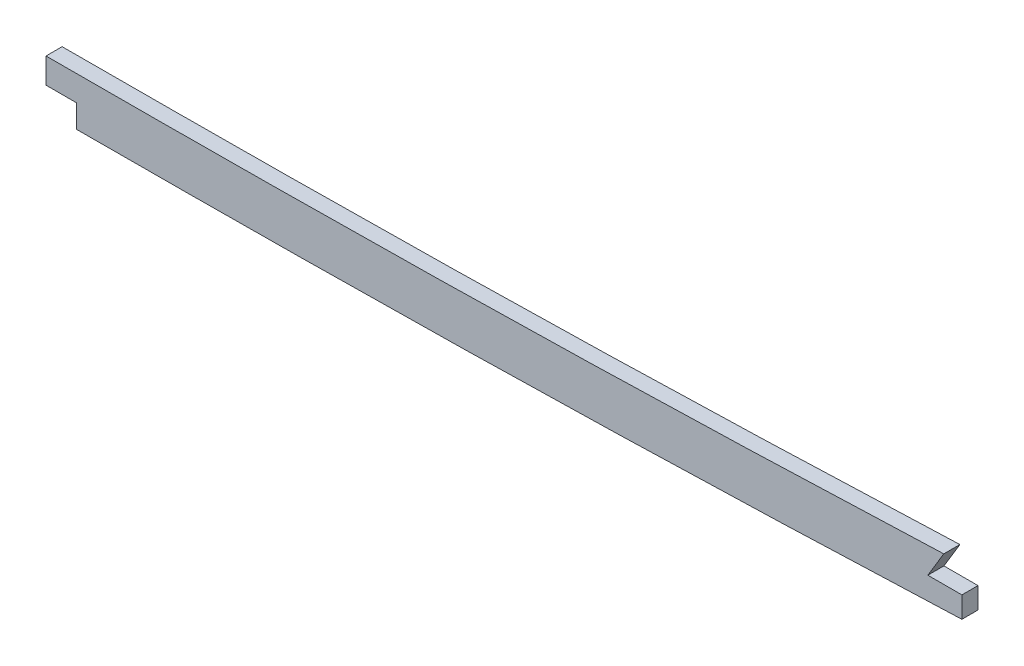
ISO-10303-21;
HEADER;
FILE_DESCRIPTION(('STEP AP214'),'2;1');
FILE_NAME('part.step','',(''),(''),'','','');
FILE_SCHEMA(('AUTOMOTIVE_DESIGN { 1 0 10303 214 1 1 1 1 }'));
ENDSEC;
DATA;
#1=APPLICATION_CONTEXT('core data for automotive mechanical design processes');
#2=APPLICATION_PROTOCOL_DEFINITION('international standard','automotive_design',2000,#1);
#3=PRODUCT_CONTEXT('',#1,'mechanical');
#4=PRODUCT('Part','Part','',(#3));
#5=PRODUCT_RELATED_PRODUCT_CATEGORY('part','',(#4));
#6=PRODUCT_DEFINITION_FORMATION('','',#4);
#7=PRODUCT_DEFINITION_CONTEXT('part definition',#1,'design');
#8=PRODUCT_DEFINITION('design','',#6,#7);
#9=PRODUCT_DEFINITION_SHAPE('','',#8);
#10=(LENGTH_UNIT() NAMED_UNIT(*) SI_UNIT(.MILLI.,.METRE.));
#11=(NAMED_UNIT(*) PLANE_ANGLE_UNIT() SI_UNIT($,.RADIAN.));
#12=(NAMED_UNIT(*) SI_UNIT($,.STERADIAN.) SOLID_ANGLE_UNIT());
#13=UNCERTAINTY_MEASURE_WITH_UNIT(LENGTH_MEASURE(1.E-05),#10,'distance_accuracy_value','');
#14=(GEOMETRIC_REPRESENTATION_CONTEXT(3) GLOBAL_UNCERTAINTY_ASSIGNED_CONTEXT((#13)) GLOBAL_UNIT_ASSIGNED_CONTEXT((#10,
#11,#12)) REPRESENTATION_CONTEXT('',''));
#15=CARTESIAN_POINT('',(0.,0.,0.));
#16=DIRECTION('',(0.,0.,1.));
#17=DIRECTION('',(1.,0.,0.));
#18=AXIS2_PLACEMENT_3D('',#15,#16,#17);
#19=CARTESIAN_POINT('',(2698.48667469404,11.4806601503293,3.175));
#20=CARTESIAN_POINT('',(2691.24737670604,10.9833200828121,3.175));
#21=CARTESIAN_POINT('',(2679.19516047804,10.1655376868452,3.175));
#22=CARTESIAN_POINT('',(2662.27652557768,9.03876140898899,3.175));
#23=CARTESIAN_POINT('',(2635.66628230206,7.2924691456857,3.175));
#24=CARTESIAN_POINT('',(2596.85766552893,4.8260568530791,3.175));
#25=CARTESIAN_POINT('',(2545.72974303923,1.75834409257586,3.175));
#26=CARTESIAN_POINT('',(2494.40530570724,-1.09855523520035,3.175));
#27=CARTESIAN_POINT('',(2451.53302226734,-3.26657329681936,3.175));
#28=CARTESIAN_POINT('',(2417.1983167563,-4.86708361008882,3.175));
#29=CARTESIAN_POINT('',(2391.45707691927,-6.00358923536048,3.175));
#30=CARTESIAN_POINT('',(2365.63473630713,-7.08685458139135,3.175));
#31=CARTESIAN_POINT('',(2339.54628467245,-8.13772994402807,3.175));
#32=CARTESIAN_POINT('',(2313.46613297408,-9.16513837136649,3.175));
#33=CARTESIAN_POINT('',(2287.61237548634,-10.1794782148021,3.175));
#34=CARTESIAN_POINT('',(2261.7633474368,-11.2010322967668,3.175));
#35=CARTESIAN_POINT('',(2227.28532971514,-12.5838425566113,3.175));
#36=CARTESIAN_POINT('',(2184.17556939327,-14.3660723604172,3.175));
#37=CARTESIAN_POINT('',(2132.42906611447,-16.6074278682384,3.175));
#38=CARTESIAN_POINT('',(2063.42552339989,-19.708920484548,3.175));
#39=CARTESIAN_POINT('',(1977.17490763451,-23.7005433130483,3.175));
#40=CARTESIAN_POINT('',(1873.73245143151,-28.149389220677,3.175));
#41=CARTESIAN_POINT('',(1770.37461881016,-31.6574686487852,3.175));
#42=CARTESIAN_POINT('',(1667.08568781321,-33.7931175563218,3.175));
#43=CARTESIAN_POINT('',(1581.01109449057,-34.3831888311612,3.175));
#44=CARTESIAN_POINT('',(1512.07397125959,-34.4278026003723,3.175));
#45=CARTESIAN_POINT('',(1443.06151347714,-34.4095104024296,3.175));
#46=CARTESIAN_POINT('',(1356.80092787913,-34.4244328117572,3.175));
#47=CARTESIAN_POINT('',(1218.79462695393,-34.4184647879491,3.175));
#48=CARTESIAN_POINT('',(1115.28902278569,-34.4207027968771,3.175));
#49=CARTESIAN_POINT('',(1046.28548189005,-34.4207027968771,3.175));
#50=B_SPLINE_CURVE_WITH_KNOTS('',3,(#19,#20,#21,#22,#23,#24,#25,#26,#27,#28,#29,#30,#31,#32,#33,
#34,#35,#36,#37,#38,#39,#40,#41,#42,#43,#44,#45,#46,#47,#48,#49),.UNSPECIFIED.,.F.,.F.,(4,1,1,1,
1,1,1,1,1,1,1,1,1,1,1,1,1,1,1,1,1,1,1,1,1,1,1,1,4),(100.654804519159,102.842388131745,
104.300777206802,105.766098402935,110.877392286712,115.988686170488,121.099980054264,
126.21127393804,128.766920879929,131.322567821817,133.878214763705,136.433861705593,
138.989508647481,141.545155589369,144.100802531257,146.656449473146,151.767743356922,
156.879037240698,161.990331124474,172.212918892027,182.43550665958,192.658094427132,
202.880682194685,213.103269962237,218.214563846014,223.32585772979,233.548445497342,
243.771033264895,264.2162088),.UNSPECIFIED.);
#51=DIRECTION('',(0.,0.,-1.));
#52=VECTOR('',#51,1.);
#53=SURFACE_OF_LINEAR_EXTRUSION('',#50,#52);
#54=CARTESIAN_POINT('',(1888.27498536147,-27.4246170150693,3.175));
#55=VERTEX_POINT('',#54);
#56=CARTESIAN_POINT('',(1534.52091804462,-34.4089341740227,3.175));
#57=VERTEX_POINT('',#56);
#58=EDGE_CURVE('E43',#55,#57,#50,.T.);
#59=ORIENTED_EDGE('',*,*,#58,.F.);
#60=DIRECTION('',(0.,0.,1.));
#61=VECTOR('',#60,1.);
#62=CARTESIAN_POINT('',(1888.27498536147,-27.4246170150693,-4.445));
#63=LINE('',#62,#61);
#64=CARTESIAN_POINT('',(1888.27498536147,-27.4246170150693,-3.175));
#65=VERTEX_POINT('',#64);
#66=EDGE_CURVE('E105',#65,#55,#63,.T.);
#67=ORIENTED_EDGE('',*,*,#66,.F.);
#68=CARTESIAN_POINT('',(2698.48667469404,11.4806601503293,-3.175));
#69=CARTESIAN_POINT('',(2691.24737670604,10.9833200828121,-3.175));
#70=CARTESIAN_POINT('',(2679.19516047804,10.1655376868452,-3.175));
#71=CARTESIAN_POINT('',(2662.27652557768,9.03876140898899,-3.175));
#72=CARTESIAN_POINT('',(2635.66628230206,7.2924691456857,-3.175));
#73=CARTESIAN_POINT('',(2596.85766552893,4.8260568530791,-3.175));
#74=CARTESIAN_POINT('',(2545.72974303923,1.75834409257586,-3.175));
#75=CARTESIAN_POINT('',(2494.40530570724,-1.09855523520035,-3.175));
#76=CARTESIAN_POINT('',(2451.53302226734,-3.26657329681936,-3.175));
#77=CARTESIAN_POINT('',(2417.1983167563,-4.86708361008882,-3.175));
#78=CARTESIAN_POINT('',(2391.45707691927,-6.00358923536048,-3.175));
#79=CARTESIAN_POINT('',(2365.63473630713,-7.08685458139135,-3.175));
#80=CARTESIAN_POINT('',(2339.54628467245,-8.13772994402807,-3.175));
#81=CARTESIAN_POINT('',(2313.46613297408,-9.16513837136649,-3.175));
#82=CARTESIAN_POINT('',(2287.61237548634,-10.1794782148021,-3.175));
#83=CARTESIAN_POINT('',(2261.7633474368,-11.2010322967668,-3.175));
#84=CARTESIAN_POINT('',(2227.28532971514,-12.5838425566113,-3.175));
#85=CARTESIAN_POINT('',(2184.17556939327,-14.3660723604172,-3.175));
#86=CARTESIAN_POINT('',(2132.42906611447,-16.6074278682384,-3.175));
#87=CARTESIAN_POINT('',(2063.42552339989,-19.708920484548,-3.175));
#88=CARTESIAN_POINT('',(1977.17490763451,-23.7005433130483,-3.175));
#89=CARTESIAN_POINT('',(1873.73245143151,-28.149389220677,-3.175));
#90=CARTESIAN_POINT('',(1770.37461881016,-31.6574686487852,-3.175));
#91=CARTESIAN_POINT('',(1667.08568781321,-33.7931175563218,-3.175));
#92=CARTESIAN_POINT('',(1581.01109449057,-34.3831888311612,-3.175));
#93=CARTESIAN_POINT('',(1512.07397125959,-34.4278026003723,-3.175));
#94=CARTESIAN_POINT('',(1443.06151347714,-34.4095104024296,-3.175));
#95=CARTESIAN_POINT('',(1356.80092787913,-34.4244328117572,-3.175));
#96=CARTESIAN_POINT('',(1218.79462695393,-34.4184647879491,-3.175));
#97=CARTESIAN_POINT('',(1115.28902278569,-34.4207027968771,-3.175));
#98=CARTESIAN_POINT('',(1046.28548189005,-34.4207027968771,-3.175));
#99=B_SPLINE_CURVE_WITH_KNOTS('',3,(#68,#69,#70,#71,#72,#73,#74,#75,#76,#77,#78,#79,#80,#81,#82,
#83,#84,#85,#86,#87,#88,#89,#90,#91,#92,#93,#94,#95,#96,#97,#98),.UNSPECIFIED.,.F.,.F.,(4,1,1,1,
1,1,1,1,1,1,1,1,1,1,1,1,1,1,1,1,1,1,1,1,1,1,1,1,4),(100.654804519159,102.842388131745,
104.300777206802,105.766098402935,110.877392286712,115.988686170488,121.099980054264,
126.21127393804,128.766920879929,131.322567821817,133.878214763705,136.433861705593,
138.989508647481,141.545155589369,144.100802531257,146.656449473146,151.767743356922,
156.879037240698,161.990331124474,172.212918892027,182.43550665958,192.658094427132,
202.880682194685,213.103269962237,218.214563846014,223.32585772979,233.548445497342,
243.771033264895,264.2162088),.UNSPECIFIED.);
#100=CARTESIAN_POINT('',(1534.52091804462,-34.4089341740227,-3.175));
#101=VERTEX_POINT('',#100);
#102=EDGE_CURVE('E140',#65,#101,#99,.T.);
#103=ORIENTED_EDGE('',*,*,#102,.T.);
#104=DIRECTION('',(0.,0.,-1.));
#105=VECTOR('',#104,1.);
#106=CARTESIAN_POINT('',(1534.52091804462,-34.4089341740227,3.175));
#107=LINE('',#106,#105);
#108=EDGE_CURVE('E130',#101,#57,#107,.F.);
#109=ORIENTED_EDGE('',*,*,#108,.T.);
#110=EDGE_LOOP('',(#59,#67,#103,#109));
#111=FACE_BOUND('',#110,.T.);
#112=ADVANCED_FACE('F38',(#111),#53,.F.);
#113=CARTESIAN_POINT('',(2699.79233294449,-7.52454325644929,3.175));
#114=CARTESIAN_POINT('',(2639.63682069028,-11.6572294058032,3.175));
#115=CARTESIAN_POINT('',(2579.48130742255,-15.435846921513,3.175));
#116=CARTESIAN_POINT('',(2518.49810546626,-19.1485286488731,3.175));
#117=CARTESIAN_POINT('',(2436.3555443117,-23.2523639114786,3.175));
#118=CARTESIAN_POINT('',(2354.21298315715,-26.6314864233564,3.175));
#119=CARTESIAN_POINT('',(2332.5703304682,-27.4809881692809,3.175));
#120=CARTESIAN_POINT('',(2156.26863942885,-34.3777685431634,3.175));
#121=CARTESIAN_POINT('',(1979.96694737597,-41.6286312484567,3.175));
#122=CARTESIAN_POINT('',(1824.11427763497,-52.7712658766203,3.175));
#123=CARTESIAN_POINT('',(1636.92860677809,-53.5795698486924,3.175));
#124=CARTESIAN_POINT('',(1449.7429359212,-53.4540246131279,3.175));
#125=CARTESIAN_POINT('',(1418.00673093479,-53.4707027968771,3.175));
#126=CARTESIAN_POINT('',(1324.89933614602,-53.4707027968771,3.175));
#127=CARTESIAN_POINT('',(1231.79194034372,-53.4707027968771,3.175));
#128=CARTESIAN_POINT('',(1170.4412693194,-53.4707027968771,3.175));
#129=CARTESIAN_POINT('',(1108.78407581299,-53.4707027968771,3.175));
#130=CARTESIAN_POINT('',(1047.12688234629,-53.4707027968771,3.175));
#131=CARTESIAN_POINT('',(1046.84641418849,-53.4707027968771,3.175));
#132=CARTESIAN_POINT('',(1046.56594718406,-53.4707027968771,3.175));
#133=CARTESIAN_POINT('',(1046.28548189005,-53.4707027968771,3.175));
#134=(BOUNDED_CURVE() B_SPLINE_CURVE(5,(#113,#114,#115,#116,#117,#118,#119,#120,#121,#122,#123,
#124,#125,#126,#127,#128,#129,#130,#131,#132,#133),.UNSPECIFIED.,.F.,
.F.) B_SPLINE_CURVE_WITH_KNOTS((6,3,3,3,3,3,6),(100.654804519159,130.927896619159,
141.337054719159,218.101815019159,233.772059419159,264.077723219159,264.2162088),
.UNSPECIFIED.) CURVE() GEOMETRIC_REPRESENTATION_ITEM() RATIONAL_B_SPLINE_CURVE((1.,1.,1.,1.,1.,
1.,1.,1.,1.,1.,1.,1.,1.,1.,1.,1.,1.,1.,1.,1.,1.)) REPRESENTATION_ITEM(''));
#135=DIRECTION('',(0.,0.,-1.));
#136=VECTOR('',#135,1.);
#137=SURFACE_OF_LINEAR_EXTRUSION('',#134,#136);
#138=DIRECTION('',(0.,0.,-1.));
#139=VECTOR('',#138,1.);
#140=CARTESIAN_POINT('',(1895.4063265018,-46.2049441321549,3.175));
#141=LINE('',#140,#139);
#142=CARTESIAN_POINT('',(1895.4063265018,-46.2049441321549,3.175));
#143=VERTEX_POINT('',#142);
#144=CARTESIAN_POINT('',(1895.4063265018,-46.2049441321549,-3.175));
#145=VERTEX_POINT('',#144);
#146=EDGE_CURVE('E152',#143,#145,#141,.T.);
#147=ORIENTED_EDGE('',*,*,#146,.F.);
#148=CARTESIAN_POINT('',(1546.51800256354,-53.4447763745865,3.175));
#149=VERTEX_POINT('',#148);
#150=EDGE_CURVE('E133',#143,#149,#134,.T.);
#151=ORIENTED_EDGE('',*,*,#150,.T.);
#152=DIRECTION('',(0.,0.,-1.));
#153=VECTOR('',#152,1.);
#154=CARTESIAN_POINT('',(1546.51800256354,-53.4447763745865,3.175));
#155=LINE('',#154,#153);
#156=CARTESIAN_POINT('',(1546.51800256354,-53.4447763745865,-3.175));
#157=VERTEX_POINT('',#156);
#158=EDGE_CURVE('E203',#157,#149,#155,.F.);
#159=ORIENTED_EDGE('',*,*,#158,.F.);
#160=CARTESIAN_POINT('',(2699.79233294449,-7.52454325644929,-3.175));
#161=CARTESIAN_POINT('',(2639.63682069028,-11.6572294058032,-3.175));
#162=CARTESIAN_POINT('',(2579.48130742255,-15.435846921513,-3.175));
#163=CARTESIAN_POINT('',(2518.49810546626,-19.1485286488731,-3.175));
#164=CARTESIAN_POINT('',(2436.3555443117,-23.2523639114786,-3.175));
#165=CARTESIAN_POINT('',(2354.21298315715,-26.6314864233564,-3.175));
#166=CARTESIAN_POINT('',(2332.5703304682,-27.4809881692809,-3.175));
#167=CARTESIAN_POINT('',(2156.26863942885,-34.3777685431634,-3.175));
#168=CARTESIAN_POINT('',(1979.96694737597,-41.6286312484567,-3.175));
#169=CARTESIAN_POINT('',(1824.11427763497,-52.7712658766203,-3.175));
#170=CARTESIAN_POINT('',(1636.92860677809,-53.5795698486924,-3.175));
#171=CARTESIAN_POINT('',(1449.7429359212,-53.4540246131279,-3.175));
#172=CARTESIAN_POINT('',(1418.00673093479,-53.4707027968771,-3.175));
#173=CARTESIAN_POINT('',(1324.89933614602,-53.4707027968771,-3.175));
#174=CARTESIAN_POINT('',(1231.79194034372,-53.4707027968771,-3.175));
#175=CARTESIAN_POINT('',(1170.4412693194,-53.4707027968771,-3.175));
#176=CARTESIAN_POINT('',(1108.78407581299,-53.4707027968771,-3.175));
#177=CARTESIAN_POINT('',(1047.12688234629,-53.4707027968771,-3.175));
#178=CARTESIAN_POINT('',(1046.84641418849,-53.4707027968771,-3.175));
#179=CARTESIAN_POINT('',(1046.56594718406,-53.4707027968771,-3.175));
#180=CARTESIAN_POINT('',(1046.28548189005,-53.4707027968771,-3.175));
#181=(BOUNDED_CURVE() B_SPLINE_CURVE(5,(#160,#161,#162,#163,#164,#165,#166,#167,#168,#169,#170,
#171,#172,#173,#174,#175,#176,#177,#178,#179,#180),.UNSPECIFIED.,.F.,
.F.) B_SPLINE_CURVE_WITH_KNOTS((6,3,3,3,3,3,6),(100.654804519159,130.927896619159,
141.337054719159,218.101815019159,233.772059419159,264.077723219159,264.2162088),
.UNSPECIFIED.) CURVE() GEOMETRIC_REPRESENTATION_ITEM() RATIONAL_B_SPLINE_CURVE((1.,1.,1.,1.,1.,
1.,1.,1.,1.,1.,1.,1.,1.,1.,1.,1.,1.,1.,1.,1.,1.)) REPRESENTATION_ITEM(''));
#182=EDGE_CURVE('E146',#145,#157,#181,.T.);
#183=ORIENTED_EDGE('',*,*,#182,.F.);
#184=EDGE_LOOP('',(#147,#151,#159,#183));
#185=FACE_BOUND('',#184,.T.);
#186=ADVANCED_FACE('F40',(#185),#137,.T.);
#187=CARTESIAN_POINT('',(0.,0.,3.175));
#188=DIRECTION('',(0.,0.,1.));
#189=DIRECTION('',(1.,0.,0.));
#190=AXIS2_PLACEMENT_3D('',#187,#188,#189);
#191=PLANE('',#190);
#192=DIRECTION('',(0.,-1.,0.));
#193=VECTOR('',#192,1.);
#194=CARTESIAN_POINT('',(1895.4063265018,-56.6643583774936,3.175));
#195=LINE('',#194,#193);
#196=CARTESIAN_POINT('',(1895.4063265018,-37.8581371150141,3.175));
#197=VERTEX_POINT('',#196);
#198=EDGE_CURVE('E117',#197,#143,#195,.T.);
#199=ORIENTED_EDGE('',*,*,#198,.F.);
#200=DIRECTION('',(1.,0.,0.));
#201=VECTOR('',#200,1.);
#202=CARTESIAN_POINT('',(1881.98614013018,-37.8581371150141,3.175));
#203=LINE('',#202,#201);
#204=CARTESIAN_POINT('',(1881.98614013018,-37.8581371150141,3.175));
#205=VERTEX_POINT('',#204);
#206=EDGE_CURVE('E125',#205,#197,#203,.T.);
#207=ORIENTED_EDGE('',*,*,#206,.F.);
#208=DIRECTION('',(-0.516228970807182,-0.856450611360257,0.));
#209=VECTOR('',#208,1.);
#210=CARTESIAN_POINT('',(1888.27498536147,-27.4246170150693,3.175));
#211=LINE('',#210,#209);
#212=EDGE_CURVE('E108',#55,#205,#211,.T.);
#213=ORIENTED_EDGE('',*,*,#212,.F.);
#214=ORIENTED_EDGE('',*,*,#58,.T.);
#215=DIRECTION('',(0.,1.,0.));
#216=VECTOR('',#215,1.);
#217=CARTESIAN_POINT('',(1534.52091804462,-34.4089341740227,3.175));
#218=LINE('',#217,#216);
#219=CARTESIAN_POINT('',(1534.52091804462,-44.3802226943777,3.175));
#220=VERTEX_POINT('',#219);
#221=EDGE_CURVE('E221',#220,#57,#218,.T.);
#222=ORIENTED_EDGE('',*,*,#221,.F.);
#223=DIRECTION('',(-1.,0.,0.));
#224=VECTOR('',#223,1.);
#225=CARTESIAN_POINT('',(1534.52091804462,-44.3802226943777,3.175));
#226=LINE('',#225,#224);
#227=CARTESIAN_POINT('',(1546.51800256354,-44.3802226943777,3.175));
#228=VERTEX_POINT('',#227);
#229=EDGE_CURVE('E224',#228,#220,#226,.T.);
#230=ORIENTED_EDGE('',*,*,#229,.F.);
#231=DIRECTION('',(0.,1.,0.));
#232=VECTOR('',#231,1.);
#233=CARTESIAN_POINT('',(1546.51800256354,-44.3802226943777,3.175));
#234=LINE('',#233,#232);
#235=EDGE_CURVE('E228',#149,#228,#234,.T.);
#236=ORIENTED_EDGE('',*,*,#235,.F.);
#237=ORIENTED_EDGE('',*,*,#150,.F.);
#238=EDGE_LOOP('',(#199,#207,#213,#214,#222,#230,#236,#237));
#239=FACE_BOUND('',#238,.T.);
#240=ADVANCED_FACE('F122',(#239),#191,.T.);
#241=CARTESIAN_POINT('',(0.,0.,-3.175));
#242=DIRECTION('',(0.,0.,1.));
#243=DIRECTION('',(1.,0.,0.));
#244=AXIS2_PLACEMENT_3D('',#241,#242,#243);
#245=PLANE('',#244);
#246=DIRECTION('',(1.,0.,0.));
#247=VECTOR('',#246,1.);
#248=CARTESIAN_POINT('',(0.,-37.8581371150141,-3.175));
#249=LINE('',#248,#247);
#250=CARTESIAN_POINT('',(1881.98614013018,-37.8581371150142,-3.175));
#251=VERTEX_POINT('',#250);
#252=CARTESIAN_POINT('',(1895.4063265018,-37.8581371150141,-3.175));
#253=VERTEX_POINT('',#252);
#254=EDGE_CURVE('E50',#251,#253,#249,.T.);
#255=ORIENTED_EDGE('',*,*,#254,.T.);
#256=DIRECTION('',(0.,-1.,0.));
#257=VECTOR('',#256,1.);
#258=CARTESIAN_POINT('',(1895.4063265018,0.,-3.175));
#259=LINE('',#258,#257);
#260=EDGE_CURVE('E11',#253,#145,#259,.T.);
#261=ORIENTED_EDGE('',*,*,#260,.T.);
#262=ORIENTED_EDGE('',*,*,#182,.T.);
#263=DIRECTION('',(0.,1.,0.));
#264=VECTOR('',#263,1.);
#265=CARTESIAN_POINT('',(1546.51800256354,0.,-3.175));
#266=LINE('',#265,#264);
#267=CARTESIAN_POINT('',(1546.51800256354,-44.3802226943777,-3.175));
#268=VERTEX_POINT('',#267);
#269=EDGE_CURVE('E132',#157,#268,#266,.T.);
#270=ORIENTED_EDGE('',*,*,#269,.T.);
#271=DIRECTION('',(-1.,0.,0.));
#272=VECTOR('',#271,1.);
#273=CARTESIAN_POINT('',(0.,-44.3802226943777,-3.175));
#274=LINE('',#273,#272);
#275=CARTESIAN_POINT('',(1534.52091804462,-44.3802226943777,-3.175));
#276=VERTEX_POINT('',#275);
#277=EDGE_CURVE('E137',#268,#276,#274,.T.);
#278=ORIENTED_EDGE('',*,*,#277,.T.);
#279=DIRECTION('',(0.,1.,0.));
#280=VECTOR('',#279,1.);
#281=CARTESIAN_POINT('',(1534.52091804462,0.,-3.175));
#282=LINE('',#281,#280);
#283=EDGE_CURVE('E237',#276,#101,#282,.T.);
#284=ORIENTED_EDGE('',*,*,#283,.T.);
#285=ORIENTED_EDGE('',*,*,#102,.F.);
#286=DIRECTION('',(-0.516228970807182,-0.856450611360257,0.));
#287=VECTOR('',#286,1.);
#288=CARTESIAN_POINT('',(1397.18924481056,-842.16130656485,-3.175));
#289=LINE('',#288,#287);
#290=EDGE_CURVE('E111',#65,#251,#289,.T.);
#291=ORIENTED_EDGE('',*,*,#290,.T.);
#292=EDGE_LOOP('',(#255,#261,#262,#270,#278,#284,#285,#291));
#293=FACE_BOUND('',#292,.T.);
#294=ADVANCED_FACE('F170',(#293),#245,.F.);
#295=CARTESIAN_POINT('',(1534.52091804462,-34.4089341740227,-4.445));
#296=DIRECTION('',(1.,0.,0.));
#297=DIRECTION('',(0.,0.,-1.));
#298=AXIS2_PLACEMENT_3D('',#295,#296,#297);
#299=PLANE('',#298);
#300=ORIENTED_EDGE('',*,*,#283,.F.);
#301=DIRECTION('',(0.,0.,1.));
#302=VECTOR('',#301,1.);
#303=CARTESIAN_POINT('',(1534.52091804462,-44.3802226943777,-4.445));
#304=LINE('',#303,#302);
#305=EDGE_CURVE('E127',#276,#220,#304,.T.);
#306=ORIENTED_EDGE('',*,*,#305,.T.);
#307=ORIENTED_EDGE('',*,*,#221,.T.);
#308=ORIENTED_EDGE('',*,*,#108,.F.);
#309=EDGE_LOOP('',(#300,#306,#307,#308));
#310=FACE_BOUND('',#309,.T.);
#311=ADVANCED_FACE('F173',(#310),#299,.F.);
#312=CARTESIAN_POINT('',(1534.52091804462,-44.3802226943777,-4.445));
#313=DIRECTION('',(0.,1.,0.));
#314=DIRECTION('',(0.,0.,1.));
#315=AXIS2_PLACEMENT_3D('',#312,#313,#314);
#316=PLANE('',#315);
#317=DIRECTION('',(0.,0.,1.));
#318=VECTOR('',#317,1.);
#319=CARTESIAN_POINT('',(1546.51800256354,-44.3802226943777,-4.445));
#320=LINE('',#319,#318);
#321=EDGE_CURVE('E65',#268,#228,#320,.T.);
#322=ORIENTED_EDGE('',*,*,#321,.T.);
#323=ORIENTED_EDGE('',*,*,#229,.T.);
#324=ORIENTED_EDGE('',*,*,#305,.F.);
#325=ORIENTED_EDGE('',*,*,#277,.F.);
#326=EDGE_LOOP('',(#322,#323,#324,#325));
#327=FACE_BOUND('',#326,.T.);
#328=ADVANCED_FACE('F181',(#327),#316,.F.);
#329=CARTESIAN_POINT('',(1546.51800256354,-44.3802226943777,-4.445));
#330=DIRECTION('',(1.,0.,0.));
#331=DIRECTION('',(0.,0.,-1.));
#332=AXIS2_PLACEMENT_3D('',#329,#330,#331);
#333=PLANE('',#332);
#334=ORIENTED_EDGE('',*,*,#158,.T.);
#335=ORIENTED_EDGE('',*,*,#235,.T.);
#336=ORIENTED_EDGE('',*,*,#321,.F.);
#337=ORIENTED_EDGE('',*,*,#269,.F.);
#338=EDGE_LOOP('',(#334,#335,#336,#337));
#339=FACE_BOUND('',#338,.T.);
#340=ADVANCED_FACE('F177',(#339),#333,.F.);
#341=CARTESIAN_POINT('',(1881.98614013018,-37.8581371150141,-4.445));
#342=DIRECTION('',(0.,-1.,0.));
#343=DIRECTION('',(0.,0.,-1.));
#344=AXIS2_PLACEMENT_3D('',#341,#342,#343);
#345=PLANE('',#344);
#346=DIRECTION('',(0.,0.,1.));
#347=VECTOR('',#346,1.);
#348=CARTESIAN_POINT('',(1881.98614013018,-37.8581371150141,-4.445));
#349=LINE('',#348,#347);
#350=EDGE_CURVE('E57',#251,#205,#349,.T.);
#351=ORIENTED_EDGE('',*,*,#350,.T.);
#352=ORIENTED_EDGE('',*,*,#206,.T.);
#353=DIRECTION('',(0.,0.,1.));
#354=VECTOR('',#353,1.);
#355=CARTESIAN_POINT('',(1895.4063265018,-37.8581371150141,-4.445));
#356=LINE('',#355,#354);
#357=EDGE_CURVE('E208',#253,#197,#356,.T.);
#358=ORIENTED_EDGE('',*,*,#357,.F.);
#359=ORIENTED_EDGE('',*,*,#254,.F.);
#360=EDGE_LOOP('',(#351,#352,#358,#359));
#361=FACE_BOUND('',#360,.T.);
#362=ADVANCED_FACE('F180',(#361),#345,.F.);
#363=CARTESIAN_POINT('',(1888.27498536147,-27.4246170150693,-4.445));
#364=DIRECTION('',(-0.856450611360257,0.516228970807182,0.));
#365=DIRECTION('',(-0.516228970807182,-0.856450611360257,0.));
#366=AXIS2_PLACEMENT_3D('',#363,#364,#365);
#367=PLANE('',#366);
#368=ORIENTED_EDGE('',*,*,#66,.T.);
#369=ORIENTED_EDGE('',*,*,#212,.T.);
#370=ORIENTED_EDGE('',*,*,#350,.F.);
#371=ORIENTED_EDGE('',*,*,#290,.F.);
#372=EDGE_LOOP('',(#368,#369,#370,#371));
#373=FACE_BOUND('',#372,.T.);
#374=ADVANCED_FACE('F107',(#373),#367,.F.);
#375=CARTESIAN_POINT('',(1895.4063265018,-56.6643583774936,-4.445));
#376=DIRECTION('',(-1.,0.,0.));
#377=DIRECTION('',(0.,0.,1.));
#378=AXIS2_PLACEMENT_3D('',#375,#376,#377);
#379=PLANE('',#378);
#380=ORIENTED_EDGE('',*,*,#146,.T.);
#381=ORIENTED_EDGE('',*,*,#260,.F.);
#382=ORIENTED_EDGE('',*,*,#357,.T.);
#383=ORIENTED_EDGE('',*,*,#198,.T.);
#384=EDGE_LOOP('',(#380,#381,#382,#383));
#385=FACE_BOUND('',#384,.T.);
#386=ADVANCED_FACE('F190',(#385),#379,.F.);
#387=CLOSED_SHELL('',(#112,#186,#240,#294,#311,#328,#340,#362,#374,#386));
#388=MANIFOLD_SOLID_BREP('B2',#387);
#389=ADVANCED_BREP_SHAPE_REPRESENTATION('',(#18,#388),#14);
#390=SHAPE_DEFINITION_REPRESENTATION(#9,#389);
ENDSEC;
END-ISO-10303-21;
